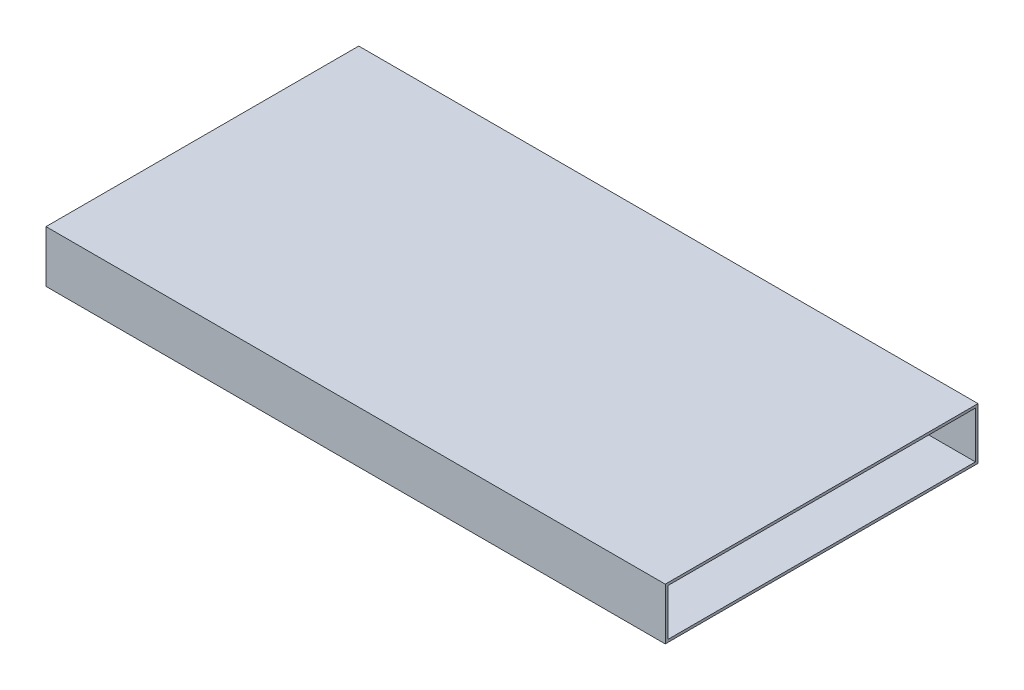
ISO-10303-21;
HEADER;
FILE_DESCRIPTION(('STEP AP214'),'2;1');
FILE_NAME('part.step','',(''),(''),'','','');
FILE_SCHEMA(('AUTOMOTIVE_DESIGN { 1 0 10303 214 1 1 1 1 }'));
ENDSEC;
DATA;
#1=APPLICATION_CONTEXT('core data for automotive mechanical design processes');
#2=APPLICATION_PROTOCOL_DEFINITION('international standard','automotive_design',2000,#1);
#3=PRODUCT_CONTEXT('',#1,'mechanical');
#4=PRODUCT('Part','Part','',(#3));
#5=PRODUCT_RELATED_PRODUCT_CATEGORY('part','',(#4));
#6=PRODUCT_DEFINITION_FORMATION('','',#4);
#7=PRODUCT_DEFINITION_CONTEXT('part definition',#1,'design');
#8=PRODUCT_DEFINITION('design','',#6,#7);
#9=PRODUCT_DEFINITION_SHAPE('','',#8);
#10=(LENGTH_UNIT() NAMED_UNIT(*) SI_UNIT(.MILLI.,.METRE.));
#11=(NAMED_UNIT(*) PLANE_ANGLE_UNIT() SI_UNIT($,.RADIAN.));
#12=(NAMED_UNIT(*) SI_UNIT($,.STERADIAN.) SOLID_ANGLE_UNIT());
#13=UNCERTAINTY_MEASURE_WITH_UNIT(LENGTH_MEASURE(1.E-05),#10,'distance_accuracy_value','');
#14=(GEOMETRIC_REPRESENTATION_CONTEXT(3) GLOBAL_UNCERTAINTY_ASSIGNED_CONTEXT((#13)) GLOBAL_UNIT_ASSIGNED_CONTEXT((#10,
#11,#12)) REPRESENTATION_CONTEXT('',''));
#15=CARTESIAN_POINT('',(0.,0.,0.));
#16=DIRECTION('',(0.,0.,1.));
#17=DIRECTION('',(1.,0.,0.));
#18=AXIS2_PLACEMENT_3D('',#15,#16,#17);
#19=CARTESIAN_POINT('',(0.,10.,0.));
#20=DIRECTION('',(-1.,0.,0.));
#21=DIRECTION('',(0.,0.,1.));
#22=AXIS2_PLACEMENT_3D('',#19,#20,#21);
#23=PLANE('',#22);
#24=DIRECTION('',(0.,0.,-1.));
#25=VECTOR('',#24,1.);
#26=CARTESIAN_POINT('',(0.,0.,0.));
#27=LINE('',#26,#25);
#28=CARTESIAN_POINT('',(0.,0.,60.3703225048464));
#29=VERTEX_POINT('',#28);
#30=CARTESIAN_POINT('',(0.,0.,0.));
#31=VERTEX_POINT('',#30);
#32=EDGE_CURVE('E146',#29,#31,#27,.T.);
#33=ORIENTED_EDGE('',*,*,#32,.T.);
#34=DIRECTION('',(0.,-1.,0.));
#35=VECTOR('',#34,1.);
#36=CARTESIAN_POINT('',(0.,10.,0.));
#37=LINE('',#36,#35);
#38=CARTESIAN_POINT('',(0.,10.,0.));
#39=VERTEX_POINT('',#38);
#40=EDGE_CURVE('E11',#39,#31,#37,.T.);
#41=ORIENTED_EDGE('',*,*,#40,.F.);
#42=DIRECTION('',(0.,0.,-1.));
#43=VECTOR('',#42,1.);
#44=CARTESIAN_POINT('',(0.,10.,0.));
#45=LINE('',#44,#43);
#46=CARTESIAN_POINT('',(0.,10.,60.3703225048464));
#47=VERTEX_POINT('',#46);
#48=EDGE_CURVE('E151',#47,#39,#45,.T.);
#49=ORIENTED_EDGE('',*,*,#48,.F.);
#50=DIRECTION('',(0.,-1.,0.));
#51=VECTOR('',#50,1.);
#52=CARTESIAN_POINT('',(0.,10.,60.3703225048464));
#53=LINE('',#52,#51);
#54=EDGE_CURVE('E157',#47,#29,#53,.T.);
#55=ORIENTED_EDGE('',*,*,#54,.T.);
#56=EDGE_LOOP('',(#33,#41,#49,#55));
#57=FACE_BOUND('',#56,.T.);
#58=DIRECTION('',(0.,0.,-1.));
#59=VECTOR('',#58,1.);
#60=CARTESIAN_POINT('',(0.,0.5,0.));
#61=LINE('',#60,#59);
#62=CARTESIAN_POINT('',(0.,0.5,59.8703225048464));
#63=VERTEX_POINT('',#62);
#64=CARTESIAN_POINT('',(0.,0.5,0.5));
#65=VERTEX_POINT('',#64);
#66=EDGE_CURVE('E117',#63,#65,#61,.T.);
#67=ORIENTED_EDGE('',*,*,#66,.F.);
#68=DIRECTION('',(0.,-1.,0.));
#69=VECTOR('',#68,1.);
#70=CARTESIAN_POINT('',(0.,10.,59.8703225048464));
#71=LINE('',#70,#69);
#72=CARTESIAN_POINT('',(0.,9.5,59.8703225048464));
#73=VERTEX_POINT('',#72);
#74=EDGE_CURVE('E140',#73,#63,#71,.T.);
#75=ORIENTED_EDGE('',*,*,#74,.F.);
#76=DIRECTION('',(0.,0.,-1.));
#77=VECTOR('',#76,1.);
#78=CARTESIAN_POINT('',(0.,9.5,0.));
#79=LINE('',#78,#77);
#80=CARTESIAN_POINT('',(0.,9.5,0.5));
#81=VERTEX_POINT('',#80);
#82=EDGE_CURVE('E51',#73,#81,#79,.T.);
#83=ORIENTED_EDGE('',*,*,#82,.T.);
#84=DIRECTION('',(0.,-1.,0.));
#85=VECTOR('',#84,1.);
#86=CARTESIAN_POINT('',(0.,10.,0.5));
#87=LINE('',#86,#85);
#88=EDGE_CURVE('E128',#81,#65,#87,.T.);
#89=ORIENTED_EDGE('',*,*,#88,.T.);
#90=EDGE_LOOP('',(#67,#75,#83,#89));
#91=FACE_BOUND('',#90,.T.);
#92=ADVANCED_FACE('F37',(#57,#91),#23,.F.);
#93=CARTESIAN_POINT('',(0.,10.,0.));
#94=DIRECTION('',(0.,0.,1.));
#95=DIRECTION('',(1.,0.,0.));
#96=AXIS2_PLACEMENT_3D('',#93,#94,#95);
#97=PLANE('',#96);
#98=DIRECTION('',(-1.,0.,0.));
#99=VECTOR('',#98,1.);
#100=CARTESIAN_POINT('',(0.,0.,0.));
#101=LINE('',#100,#99);
#102=CARTESIAN_POINT('',(-119.537249876706,0.,0.));
#103=VERTEX_POINT('',#102);
#104=EDGE_CURVE('E160',#31,#103,#101,.T.);
#105=ORIENTED_EDGE('',*,*,#104,.T.);
#106=DIRECTION('',(0.,-1.,0.));
#107=VECTOR('',#106,1.);
#108=CARTESIAN_POINT('',(-119.537249876706,10.,0.));
#109=LINE('',#108,#107);
#110=CARTESIAN_POINT('',(-119.537249876706,10.,0.));
#111=VERTEX_POINT('',#110);
#112=EDGE_CURVE('E44',#111,#103,#109,.T.);
#113=ORIENTED_EDGE('',*,*,#112,.F.);
#114=DIRECTION('',(-1.,0.,0.));
#115=VECTOR('',#114,1.);
#116=CARTESIAN_POINT('',(0.,10.,0.));
#117=LINE('',#116,#115);
#118=EDGE_CURVE('E88',#39,#111,#117,.T.);
#119=ORIENTED_EDGE('',*,*,#118,.F.);
#120=ORIENTED_EDGE('',*,*,#40,.T.);
#121=EDGE_LOOP('',(#105,#113,#119,#120));
#122=FACE_BOUND('',#121,.T.);
#123=ADVANCED_FACE('F189',(#122),#97,.F.);
#124=CARTESIAN_POINT('',(-119.537249876706,10.,0.));
#125=DIRECTION('',(1.,0.,0.));
#126=DIRECTION('',(0.,0.,-1.));
#127=AXIS2_PLACEMENT_3D('',#124,#125,#126);
#128=PLANE('',#127);
#129=DIRECTION('',(0.,0.,1.));
#130=VECTOR('',#129,1.);
#131=CARTESIAN_POINT('',(-119.537249876706,0.,0.));
#132=LINE('',#131,#130);
#133=CARTESIAN_POINT('',(-119.537249876706,0.,60.3703225048464));
#134=VERTEX_POINT('',#133);
#135=EDGE_CURVE('E162',#103,#134,#132,.T.);
#136=ORIENTED_EDGE('',*,*,#135,.T.);
#137=DIRECTION('',(0.,-1.,0.));
#138=VECTOR('',#137,1.);
#139=CARTESIAN_POINT('',(-119.537249876706,10.,60.3703225048464));
#140=LINE('',#139,#138);
#141=CARTESIAN_POINT('',(-119.537249876706,10.,60.3703225048464));
#142=VERTEX_POINT('',#141);
#143=EDGE_CURVE('E166',#142,#134,#140,.T.);
#144=ORIENTED_EDGE('',*,*,#143,.F.);
#145=DIRECTION('',(0.,0.,1.));
#146=VECTOR('',#145,1.);
#147=CARTESIAN_POINT('',(-119.537249876706,10.,0.));
#148=LINE('',#147,#146);
#149=EDGE_CURVE('E154',#111,#142,#148,.T.);
#150=ORIENTED_EDGE('',*,*,#149,.F.);
#151=ORIENTED_EDGE('',*,*,#112,.T.);
#152=EDGE_LOOP('',(#136,#144,#150,#151));
#153=FACE_BOUND('',#152,.T.);
#154=ADVANCED_FACE('F171',(#153),#128,.F.);
#155=CARTESIAN_POINT('',(0.,10.,60.3703225048464));
#156=DIRECTION('',(0.,0.,-1.));
#157=DIRECTION('',(-1.,0.,0.));
#158=AXIS2_PLACEMENT_3D('',#155,#156,#157);
#159=PLANE('',#158);
#160=DIRECTION('',(1.,0.,0.));
#161=VECTOR('',#160,1.);
#162=CARTESIAN_POINT('',(0.,0.,60.3703225048464));
#163=LINE('',#162,#161);
#164=EDGE_CURVE('E81',#134,#29,#163,.T.);
#165=ORIENTED_EDGE('',*,*,#164,.T.);
#166=ORIENTED_EDGE('',*,*,#54,.F.);
#167=DIRECTION('',(1.,0.,0.));
#168=VECTOR('',#167,1.);
#169=CARTESIAN_POINT('',(0.,10.,60.3703225048464));
#170=LINE('',#169,#168);
#171=EDGE_CURVE('E60',#142,#47,#170,.T.);
#172=ORIENTED_EDGE('',*,*,#171,.F.);
#173=ORIENTED_EDGE('',*,*,#143,.T.);
#174=EDGE_LOOP('',(#165,#166,#172,#173));
#175=FACE_BOUND('',#174,.T.);
#176=ADVANCED_FACE('F180',(#175),#159,.F.);
#177=CARTESIAN_POINT('',(0.,10.,0.));
#178=DIRECTION('',(0.,-1.,0.));
#179=DIRECTION('',(0.,0.,-1.));
#180=AXIS2_PLACEMENT_3D('',#177,#178,#179);
#181=PLANE('',#180);
#182=ORIENTED_EDGE('',*,*,#48,.T.);
#183=ORIENTED_EDGE('',*,*,#118,.T.);
#184=ORIENTED_EDGE('',*,*,#149,.T.);
#185=ORIENTED_EDGE('',*,*,#171,.T.);
#186=EDGE_LOOP('',(#182,#183,#184,#185));
#187=FACE_BOUND('',#186,.T.);
#188=ADVANCED_FACE('F182',(#187),#181,.F.);
#189=CARTESIAN_POINT('',(0.,0.,0.));
#190=DIRECTION('',(0.,-1.,0.));
#191=DIRECTION('',(0.,0.,-1.));
#192=AXIS2_PLACEMENT_3D('',#189,#190,#191);
#193=PLANE('',#192);
#194=ORIENTED_EDGE('',*,*,#32,.F.);
#195=ORIENTED_EDGE('',*,*,#164,.F.);
#196=ORIENTED_EDGE('',*,*,#135,.F.);
#197=ORIENTED_EDGE('',*,*,#104,.F.);
#198=EDGE_LOOP('',(#194,#195,#196,#197));
#199=FACE_BOUND('',#198,.T.);
#200=ADVANCED_FACE('F175',(#199),#193,.T.);
#201=CARTESIAN_POINT('',(0.,10.,0.5));
#202=DIRECTION('',(0.,0.,1.));
#203=DIRECTION('',(1.,0.,0.));
#204=AXIS2_PLACEMENT_3D('',#201,#202,#203);
#205=PLANE('',#204);
#206=DIRECTION('',(-1.,0.,0.));
#207=VECTOR('',#206,1.);
#208=CARTESIAN_POINT('',(0.,0.5,0.5));
#209=LINE('',#208,#207);
#210=CARTESIAN_POINT('',(-119.037249876706,0.5,0.5));
#211=VERTEX_POINT('',#210);
#212=EDGE_CURVE('E110',#65,#211,#209,.T.);
#213=ORIENTED_EDGE('',*,*,#212,.F.);
#214=ORIENTED_EDGE('',*,*,#88,.F.);
#215=DIRECTION('',(-1.,0.,0.));
#216=VECTOR('',#215,1.);
#217=CARTESIAN_POINT('',(0.,9.5,0.5));
#218=LINE('',#217,#216);
#219=CARTESIAN_POINT('',(-119.037249876706,9.5,0.5));
#220=VERTEX_POINT('',#219);
#221=EDGE_CURVE('E125',#81,#220,#218,.T.);
#222=ORIENTED_EDGE('',*,*,#221,.T.);
#223=DIRECTION('',(0.,-1.,0.));
#224=VECTOR('',#223,1.);
#225=CARTESIAN_POINT('',(-119.037249876706,10.,0.5));
#226=LINE('',#225,#224);
#227=EDGE_CURVE('E123',#220,#211,#226,.T.);
#228=ORIENTED_EDGE('',*,*,#227,.T.);
#229=EDGE_LOOP('',(#213,#214,#222,#228));
#230=FACE_BOUND('',#229,.T.);
#231=ADVANCED_FACE('F124',(#230),#205,.T.);
#232=CARTESIAN_POINT('',(-119.037249876706,10.,0.));
#233=DIRECTION('',(1.,0.,0.));
#234=DIRECTION('',(0.,0.,-1.));
#235=AXIS2_PLACEMENT_3D('',#232,#233,#234);
#236=PLANE('',#235);
#237=DIRECTION('',(0.,0.,1.));
#238=VECTOR('',#237,1.);
#239=CARTESIAN_POINT('',(-119.037249876706,0.5,0.));
#240=LINE('',#239,#238);
#241=CARTESIAN_POINT('',(-119.037249876706,0.5,59.8703225048464));
#242=VERTEX_POINT('',#241);
#243=EDGE_CURVE('E114',#211,#242,#240,.T.);
#244=ORIENTED_EDGE('',*,*,#243,.F.);
#245=ORIENTED_EDGE('',*,*,#227,.F.);
#246=DIRECTION('',(0.,0.,1.));
#247=VECTOR('',#246,1.);
#248=CARTESIAN_POINT('',(-119.037249876706,9.5,0.));
#249=LINE('',#248,#247);
#250=CARTESIAN_POINT('',(-119.037249876706,9.5,59.8703225048464));
#251=VERTEX_POINT('',#250);
#252=EDGE_CURVE('E141',#220,#251,#249,.T.);
#253=ORIENTED_EDGE('',*,*,#252,.T.);
#254=DIRECTION('',(0.,-1.,0.));
#255=VECTOR('',#254,1.);
#256=CARTESIAN_POINT('',(-119.037249876706,10.,59.8703225048464));
#257=LINE('',#256,#255);
#258=EDGE_CURVE('E129',#251,#242,#257,.T.);
#259=ORIENTED_EDGE('',*,*,#258,.T.);
#260=EDGE_LOOP('',(#244,#245,#253,#259));
#261=FACE_BOUND('',#260,.T.);
#262=ADVANCED_FACE('F131',(#261),#236,.T.);
#263=CARTESIAN_POINT('',(0.,10.,59.8703225048464));
#264=DIRECTION('',(0.,0.,-1.));
#265=DIRECTION('',(-1.,0.,0.));
#266=AXIS2_PLACEMENT_3D('',#263,#264,#265);
#267=PLANE('',#266);
#268=DIRECTION('',(1.,0.,0.));
#269=VECTOR('',#268,1.);
#270=CARTESIAN_POINT('',(0.,0.5,59.8703225048464));
#271=LINE('',#270,#269);
#272=EDGE_CURVE('E134',#242,#63,#271,.T.);
#273=ORIENTED_EDGE('',*,*,#272,.F.);
#274=ORIENTED_EDGE('',*,*,#258,.F.);
#275=DIRECTION('',(1.,0.,0.));
#276=VECTOR('',#275,1.);
#277=CARTESIAN_POINT('',(0.,9.5,59.8703225048464));
#278=LINE('',#277,#276);
#279=EDGE_CURVE('E142',#251,#73,#278,.T.);
#280=ORIENTED_EDGE('',*,*,#279,.T.);
#281=ORIENTED_EDGE('',*,*,#74,.T.);
#282=EDGE_LOOP('',(#273,#274,#280,#281));
#283=FACE_BOUND('',#282,.T.);
#284=ADVANCED_FACE('F240',(#283),#267,.T.);
#285=CARTESIAN_POINT('',(0.,9.5,0.));
#286=DIRECTION('',(0.,-1.,0.));
#287=DIRECTION('',(0.,0.,-1.));
#288=AXIS2_PLACEMENT_3D('',#285,#286,#287);
#289=PLANE('',#288);
#290=ORIENTED_EDGE('',*,*,#82,.F.);
#291=ORIENTED_EDGE('',*,*,#279,.F.);
#292=ORIENTED_EDGE('',*,*,#252,.F.);
#293=ORIENTED_EDGE('',*,*,#221,.F.);
#294=EDGE_LOOP('',(#290,#291,#292,#293));
#295=FACE_BOUND('',#294,.T.);
#296=ADVANCED_FACE('F249',(#295),#289,.T.);
#297=CARTESIAN_POINT('',(0.,0.5,0.));
#298=DIRECTION('',(0.,-1.,0.));
#299=DIRECTION('',(0.,0.,-1.));
#300=AXIS2_PLACEMENT_3D('',#297,#298,#299);
#301=PLANE('',#300);
#302=ORIENTED_EDGE('',*,*,#66,.T.);
#303=ORIENTED_EDGE('',*,*,#212,.T.);
#304=ORIENTED_EDGE('',*,*,#243,.T.);
#305=ORIENTED_EDGE('',*,*,#272,.T.);
#306=EDGE_LOOP('',(#302,#303,#304,#305));
#307=FACE_BOUND('',#306,.T.);
#308=ADVANCED_FACE('F112',(#307),#301,.F.);
#309=CLOSED_SHELL('',(#92,#123,#154,#176,#188,#200,#231,#262,#284,#296,#308));
#310=MANIFOLD_SOLID_BREP('B2',#309);
#311=ADVANCED_BREP_SHAPE_REPRESENTATION('',(#18,#310),#14);
#312=SHAPE_DEFINITION_REPRESENTATION(#9,#311);
ENDSEC;
END-ISO-10303-21;
